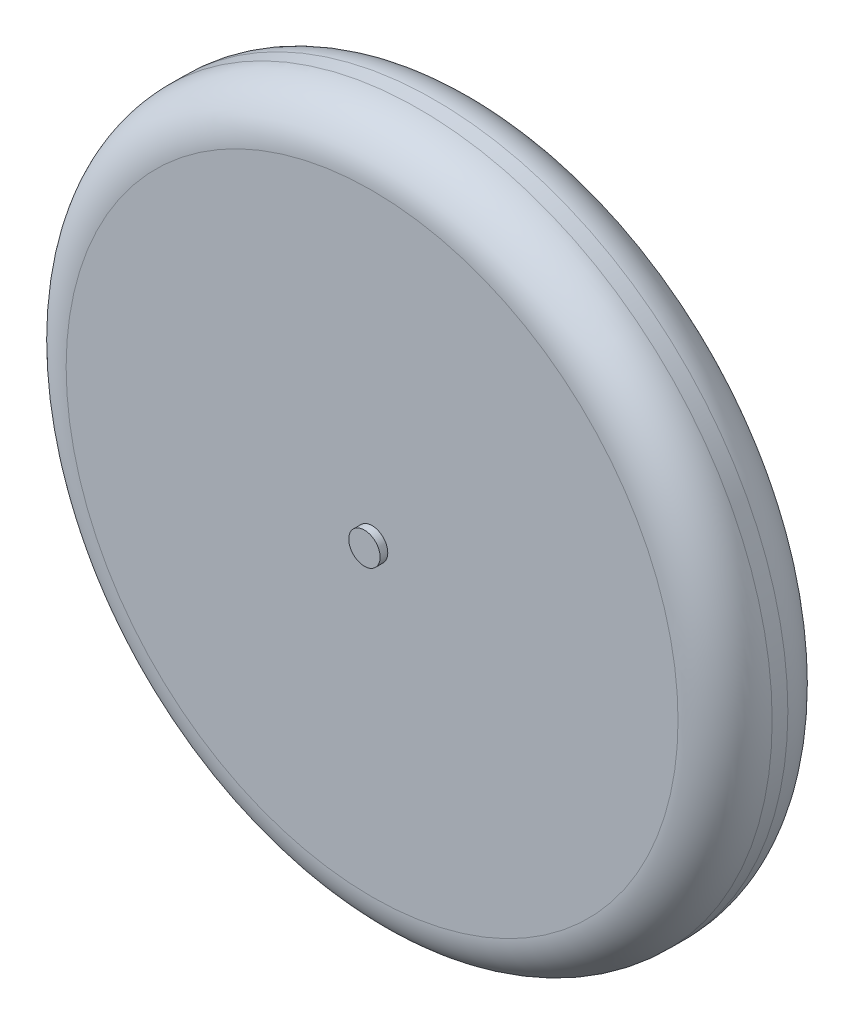
ISO-10303-21;
HEADER;
FILE_DESCRIPTION(('STEP AP214'),'2;1');
FILE_NAME('part.step','',(''),(''),'','','');
FILE_SCHEMA(('AUTOMOTIVE_DESIGN { 1 0 10303 214 1 1 1 1 }'));
ENDSEC;
DATA;
#1=APPLICATION_CONTEXT('core data for automotive mechanical design processes');
#2=APPLICATION_PROTOCOL_DEFINITION('international standard','automotive_design',2000,#1);
#3=PRODUCT_CONTEXT('',#1,'mechanical');
#4=PRODUCT('Part','Part','',(#3));
#5=PRODUCT_RELATED_PRODUCT_CATEGORY('part','',(#4));
#6=PRODUCT_DEFINITION_FORMATION('','',#4);
#7=PRODUCT_DEFINITION_CONTEXT('part definition',#1,'design');
#8=PRODUCT_DEFINITION('design','',#6,#7);
#9=PRODUCT_DEFINITION_SHAPE('','',#8);
#10=(LENGTH_UNIT() NAMED_UNIT(*) SI_UNIT(.MILLI.,.METRE.));
#11=(NAMED_UNIT(*) PLANE_ANGLE_UNIT() SI_UNIT($,.RADIAN.));
#12=(NAMED_UNIT(*) SI_UNIT($,.STERADIAN.) SOLID_ANGLE_UNIT());
#13=UNCERTAINTY_MEASURE_WITH_UNIT(LENGTH_MEASURE(1.E-05),#10,'distance_accuracy_value','');
#14=(GEOMETRIC_REPRESENTATION_CONTEXT(3) GLOBAL_UNCERTAINTY_ASSIGNED_CONTEXT((#13)) GLOBAL_UNIT_ASSIGNED_CONTEXT((#10,
#11,#12)) REPRESENTATION_CONTEXT('',''));
#15=CARTESIAN_POINT('',(0.,0.,0.));
#16=DIRECTION('',(0.,0.,1.));
#17=DIRECTION('',(1.,0.,0.));
#18=AXIS2_PLACEMENT_3D('',#15,#16,#17);
#19=CARTESIAN_POINT('',(0.,0.,20.2589384958346));
#20=DIRECTION('',(0.,0.,1.));
#21=DIRECTION('',(1.,0.,0.));
#22=AXIS2_PLACEMENT_3D('',#19,#20,#21);
#23=PLANE('',#22);
#24=CARTESIAN_POINT('',(0.,0.,20.2589384958346));
#25=DIRECTION('',(0.,0.,1.));
#26=DIRECTION('',(1.,0.,0.));
#27=AXIS2_PLACEMENT_3D('',#24,#25,#26);
#28=CIRCLE('',#27,2.54);
#29=CARTESIAN_POINT('',(2.54,0.,20.2589384958346));
#30=VERTEX_POINT('',#29);
#31=EDGE_CURVE('E10',#30,#30,#28,.T.);
#32=ORIENTED_EDGE('',*,*,#31,.T.);
#33=EDGE_LOOP('',(#32));
#34=FACE_BOUND('',#33,.T.);
#35=ADVANCED_FACE('F31',(#34),#23,.T.);
#36=CARTESIAN_POINT('',(0.,0.,20.2589384958346));
#37=DIRECTION('',(0.,0.,1.));
#38=DIRECTION('',(1.,0.,0.));
#39=AXIS2_PLACEMENT_3D('',#36,#37,#38);
#40=CYLINDRICAL_SURFACE('',#39,2.54);
#41=CARTESIAN_POINT('',(0.,0.,19.0194692479173));
#42=DIRECTION('',(0.,0.,1.));
#43=DIRECTION('',(1.,0.,0.));
#44=AXIS2_PLACEMENT_3D('',#41,#42,#43);
#45=CIRCLE('',#44,2.54);
#46=CARTESIAN_POINT('',(2.54,0.,19.0194692479173));
#47=VERTEX_POINT('',#46);
#48=EDGE_CURVE('E37',#47,#47,#45,.T.);
#49=ORIENTED_EDGE('',*,*,#48,.T.);
#50=EDGE_LOOP('',(#49));
#51=FACE_BOUND('',#50,.T.);
#52=ORIENTED_EDGE('',*,*,#31,.F.);
#53=EDGE_LOOP('',(#52));
#54=FACE_BOUND('',#53,.T.);
#55=ADVANCED_FACE('F75',(#51,#54),#40,.T.);
#56=CARTESIAN_POINT('',(2.54,0.,19.0194692479173));
#57=DIRECTION('',(0.,0.,1.));
#58=DIRECTION('',(1.,0.,0.));
#59=AXIS2_PLACEMENT_3D('',#56,#57,#58);
#60=PLANE('',#59);
#61=CARTESIAN_POINT('',(0.,0.,19.0194692479173));
#62=DIRECTION('',(0.,0.,1.));
#63=DIRECTION('',(1.,0.,0.));
#64=AXIS2_PLACEMENT_3D('',#61,#62,#63);
#65=CIRCLE('',#64,49.53);
#66=CARTESIAN_POINT('',(49.53,0.,19.0194692479173));
#67=VERTEX_POINT('',#66);
#68=EDGE_CURVE('E41',#67,#67,#65,.T.);
#69=ORIENTED_EDGE('',*,*,#68,.T.);
#70=EDGE_LOOP('',(#69));
#71=FACE_BOUND('',#70,.T.);
#72=ORIENTED_EDGE('',*,*,#48,.F.);
#73=EDGE_LOOP('',(#72));
#74=FACE_BOUND('',#73,.T.);
#75=ADVANCED_FACE('F79',(#71,#74),#60,.T.);
#76=CARTESIAN_POINT('',(0.,0.,11.3994692479173));
#77=DIRECTION('',(0.,0.,1.));
#78=DIRECTION('',(1.,0.,0.));
#79=AXIS2_PLACEMENT_3D('',#76,#77,#78);
#80=TOROIDAL_SURFACE('',#79,49.53,7.62);
#81=CARTESIAN_POINT('',(0.,0.,11.3994692479172));
#82=DIRECTION('',(0.,0.,1.));
#83=DIRECTION('',(1.,0.,0.));
#84=AXIS2_PLACEMENT_3D('',#81,#82,#83);
#85=CIRCLE('',#84,57.15);
#86=CARTESIAN_POINT('',(57.15,0.,11.3994692479172));
#87=VERTEX_POINT('',#86);
#88=EDGE_CURVE('E45',#87,#87,#85,.T.);
#89=ORIENTED_EDGE('',*,*,#88,.T.);
#90=EDGE_LOOP('',(#89));
#91=FACE_BOUND('',#90,.T.);
#92=ORIENTED_EDGE('',*,*,#68,.F.);
#93=EDGE_LOOP('',(#92));
#94=FACE_BOUND('',#93,.T.);
#95=ADVANCED_FACE('F83',(#91,#94),#80,.T.);
#96=CARTESIAN_POINT('',(0.,0.,20.2589384958346));
#97=DIRECTION('',(0.,0.,1.));
#98=DIRECTION('',(1.,0.,0.));
#99=AXIS2_PLACEMENT_3D('',#96,#97,#98);
#100=CYLINDRICAL_SURFACE('',#99,57.15);
#101=CARTESIAN_POINT('',(0.,0.,8.85946924791733));
#102=DIRECTION('',(0.,0.,1.));
#103=DIRECTION('',(1.,0.,0.));
#104=AXIS2_PLACEMENT_3D('',#101,#102,#103);
#105=CIRCLE('',#104,57.15);
#106=CARTESIAN_POINT('',(57.15,0.,8.85946924791733));
#107=VERTEX_POINT('',#106);
#108=EDGE_CURVE('E50',#107,#107,#105,.T.);
#109=ORIENTED_EDGE('',*,*,#108,.T.);
#110=EDGE_LOOP('',(#109));
#111=FACE_BOUND('',#110,.T.);
#112=ORIENTED_EDGE('',*,*,#88,.F.);
#113=EDGE_LOOP('',(#112));
#114=FACE_BOUND('',#113,.T.);
#115=ADVANCED_FACE('F90',(#111,#114),#100,.T.);
#116=CARTESIAN_POINT('',(0.,0.,8.85946924791728));
#117=DIRECTION('',(0.,0.,1.));
#118=DIRECTION('',(1.,0.,0.));
#119=AXIS2_PLACEMENT_3D('',#116,#117,#118);
#120=TOROIDAL_SURFACE('',#119,49.53,7.62);
#121=CARTESIAN_POINT('',(0.,0.,1.23946924791728));
#122=DIRECTION('',(0.,0.,1.));
#123=DIRECTION('',(1.,0.,0.));
#124=AXIS2_PLACEMENT_3D('',#121,#122,#123);
#125=CIRCLE('',#124,49.53);
#126=CARTESIAN_POINT('',(49.53,0.,1.23946924791728));
#127=VERTEX_POINT('',#126);
#128=EDGE_CURVE('E53',#127,#127,#125,.T.);
#129=ORIENTED_EDGE('',*,*,#128,.T.);
#130=EDGE_LOOP('',(#129));
#131=FACE_BOUND('',#130,.T.);
#132=ORIENTED_EDGE('',*,*,#108,.F.);
#133=EDGE_LOOP('',(#132));
#134=FACE_BOUND('',#133,.T.);
#135=ADVANCED_FACE('F94',(#131,#134),#120,.T.);
#136=CARTESIAN_POINT('',(2.54,0.,1.23946924791728));
#137=DIRECTION('',(0.,0.,-1.));
#138=DIRECTION('',(-1.,0.,0.));
#139=AXIS2_PLACEMENT_3D('',#136,#137,#138);
#140=PLANE('',#139);
#141=CARTESIAN_POINT('',(0.,0.,1.23946924791728));
#142=DIRECTION('',(0.,0.,1.));
#143=DIRECTION('',(1.,0.,0.));
#144=AXIS2_PLACEMENT_3D('',#141,#142,#143);
#145=CIRCLE('',#144,2.54);
#146=CARTESIAN_POINT('',(2.54,0.,1.23946924791728));
#147=VERTEX_POINT('',#146);
#148=EDGE_CURVE('E56',#147,#147,#145,.T.);
#149=ORIENTED_EDGE('',*,*,#148,.T.);
#150=EDGE_LOOP('',(#149));
#151=FACE_BOUND('',#150,.T.);
#152=ORIENTED_EDGE('',*,*,#128,.F.);
#153=EDGE_LOOP('',(#152));
#154=FACE_BOUND('',#153,.T.);
#155=ADVANCED_FACE('F72',(#151,#154),#140,.T.);
#156=CARTESIAN_POINT('',(0.,0.,20.2589384958346));
#157=DIRECTION('',(0.,0.,1.));
#158=DIRECTION('',(1.,0.,0.));
#159=AXIS2_PLACEMENT_3D('',#156,#157,#158);
#160=CYLINDRICAL_SURFACE('',#159,2.54);
#161=CARTESIAN_POINT('',(0.,0.,0.));
#162=DIRECTION('',(0.,0.,1.));
#163=DIRECTION('',(1.,0.,0.));
#164=AXIS2_PLACEMENT_3D('',#161,#162,#163);
#165=CIRCLE('',#164,2.54);
#166=CARTESIAN_POINT('',(2.54,0.,0.));
#167=VERTEX_POINT('',#166);
#168=EDGE_CURVE('E59',#167,#167,#165,.T.);
#169=ORIENTED_EDGE('',*,*,#168,.T.);
#170=EDGE_LOOP('',(#169));
#171=FACE_BOUND('',#170,.T.);
#172=ORIENTED_EDGE('',*,*,#148,.F.);
#173=EDGE_LOOP('',(#172));
#174=FACE_BOUND('',#173,.T.);
#175=ADVANCED_FACE('F63',(#171,#174),#160,.T.);
#176=CARTESIAN_POINT('',(0.,0.,0.));
#177=DIRECTION('',(0.,0.,-1.));
#178=DIRECTION('',(-1.,0.,0.));
#179=AXIS2_PLACEMENT_3D('',#176,#177,#178);
#180=PLANE('',#179);
#181=ORIENTED_EDGE('',*,*,#168,.F.);
#182=EDGE_LOOP('',(#181));
#183=FACE_BOUND('',#182,.T.);
#184=ADVANCED_FACE('F66',(#183),#180,.T.);
#185=CLOSED_SHELL('',(#35,#55,#75,#95,#115,#135,#155,#175,#184));
#186=MANIFOLD_SOLID_BREP('B2',#185);
#187=ADVANCED_BREP_SHAPE_REPRESENTATION('',(#18,#186),#14);
#188=SHAPE_DEFINITION_REPRESENTATION(#9,#187);
ENDSEC;
END-ISO-10303-21;
